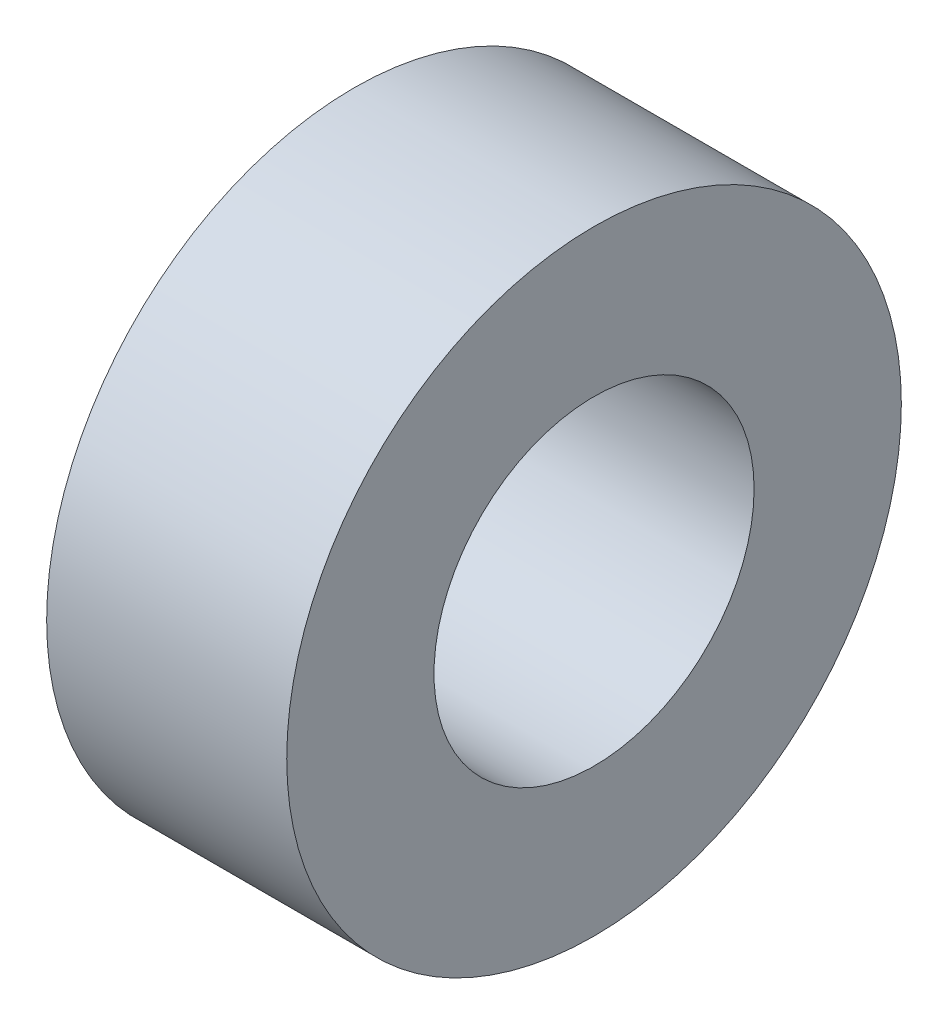
ISO-10303-21;
HEADER;
FILE_DESCRIPTION(('STEP AP214'),'2;1');
FILE_NAME('part.step','',(''),(''),'','','');
FILE_SCHEMA(('AUTOMOTIVE_DESIGN { 1 0 10303 214 1 1 1 1 }'));
ENDSEC;
DATA;
#1=APPLICATION_CONTEXT('core data for automotive mechanical design processes');
#2=APPLICATION_PROTOCOL_DEFINITION('international standard','automotive_design',2000,#1);
#3=PRODUCT_CONTEXT('',#1,'mechanical');
#4=PRODUCT('Part','Part','',(#3));
#5=PRODUCT_RELATED_PRODUCT_CATEGORY('part','',(#4));
#6=PRODUCT_DEFINITION_FORMATION('','',#4);
#7=PRODUCT_DEFINITION_CONTEXT('part definition',#1,'design');
#8=PRODUCT_DEFINITION('design','',#6,#7);
#9=PRODUCT_DEFINITION_SHAPE('','',#8);
#10=(LENGTH_UNIT() NAMED_UNIT(*) SI_UNIT(.MILLI.,.METRE.));
#11=(NAMED_UNIT(*) PLANE_ANGLE_UNIT() SI_UNIT($,.RADIAN.));
#12=(NAMED_UNIT(*) SI_UNIT($,.STERADIAN.) SOLID_ANGLE_UNIT());
#13=UNCERTAINTY_MEASURE_WITH_UNIT(LENGTH_MEASURE(1.E-05),#10,'distance_accuracy_value','');
#14=(GEOMETRIC_REPRESENTATION_CONTEXT(3) GLOBAL_UNCERTAINTY_ASSIGNED_CONTEXT((#13)) GLOBAL_UNIT_ASSIGNED_CONTEXT((#10,
#11,#12)) REPRESENTATION_CONTEXT('',''));
#15=CARTESIAN_POINT('',(0.,0.,0.));
#16=DIRECTION('',(0.,0.,1.));
#17=DIRECTION('',(1.,0.,0.));
#18=AXIS2_PLACEMENT_3D('',#15,#16,#17);
#19=CARTESIAN_POINT('',(4.7625,0.,0.));
#20=DIRECTION('',(1.,0.,0.));
#21=DIRECTION('',(0.,0.,-1.));
#22=AXIS2_PLACEMENT_3D('',#19,#20,#21);
#23=PLANE('',#22);
#24=CARTESIAN_POINT('',(4.7625,0.,0.));
#25=DIRECTION('',(1.,0.,0.));
#26=DIRECTION('',(0.,0.,-1.));
#27=AXIS2_PLACEMENT_3D('',#24,#25,#26);
#28=CIRCLE('',#27,6.096);
#29=CARTESIAN_POINT('',(4.7625,0.,-6.096));
#30=VERTEX_POINT('',#29);
#31=EDGE_CURVE('E10',#30,#30,#28,.T.);
#32=ORIENTED_EDGE('',*,*,#31,.T.);
#33=EDGE_LOOP('',(#32));
#34=FACE_BOUND('',#33,.T.);
#35=CARTESIAN_POINT('',(4.7625,0.,0.));
#36=DIRECTION('',(1.,0.,0.));
#37=DIRECTION('',(0.,0.,-1.));
#38=AXIS2_PLACEMENT_3D('',#35,#36,#37);
#39=CIRCLE('',#38,3.175);
#40=CARTESIAN_POINT('',(4.7625,0.,-3.175));
#41=VERTEX_POINT('',#40);
#42=EDGE_CURVE('E50',#41,#41,#39,.T.);
#43=ORIENTED_EDGE('',*,*,#42,.F.);
#44=EDGE_LOOP('',(#43));
#45=FACE_BOUND('',#44,.T.);
#46=ADVANCED_FACE('F39',(#34,#45),#23,.T.);
#47=CARTESIAN_POINT('',(0.,0.,0.));
#48=DIRECTION('',(1.,0.,0.));
#49=DIRECTION('',(0.,0.,-1.));
#50=AXIS2_PLACEMENT_3D('',#47,#48,#49);
#51=PLANE('',#50);
#52=CARTESIAN_POINT('',(0.,0.,0.));
#53=DIRECTION('',(1.,0.,0.));
#54=DIRECTION('',(0.,0.,-1.));
#55=AXIS2_PLACEMENT_3D('',#52,#53,#54);
#56=CIRCLE('',#55,6.096);
#57=CARTESIAN_POINT('',(0.,0.,-6.096));
#58=VERTEX_POINT('',#57);
#59=EDGE_CURVE('E43',#58,#58,#56,.T.);
#60=ORIENTED_EDGE('',*,*,#59,.F.);
#61=EDGE_LOOP('',(#60));
#62=FACE_BOUND('',#61,.T.);
#63=CARTESIAN_POINT('',(0.,0.,0.));
#64=DIRECTION('',(1.,0.,0.));
#65=DIRECTION('',(0.,0.,-1.));
#66=AXIS2_PLACEMENT_3D('',#63,#64,#65);
#67=CIRCLE('',#66,3.175);
#68=CARTESIAN_POINT('',(0.,0.,-3.175));
#69=VERTEX_POINT('',#68);
#70=EDGE_CURVE('E52',#69,#69,#67,.T.);
#71=ORIENTED_EDGE('',*,*,#70,.T.);
#72=EDGE_LOOP('',(#71));
#73=FACE_BOUND('',#72,.T.);
#74=ADVANCED_FACE('F62',(#62,#73),#51,.F.);
#75=CARTESIAN_POINT('',(4.7625,0.,0.));
#76=DIRECTION('',(-1.,0.,0.));
#77=DIRECTION('',(0.,0.,1.));
#78=AXIS2_PLACEMENT_3D('',#75,#76,#77);
#79=CYLINDRICAL_SURFACE('',#78,6.096);
#80=ORIENTED_EDGE('',*,*,#31,.F.);
#81=EDGE_LOOP('',(#80));
#82=FACE_BOUND('',#81,.T.);
#83=ORIENTED_EDGE('',*,*,#59,.T.);
#84=EDGE_LOOP('',(#83));
#85=FACE_BOUND('',#84,.T.);
#86=ADVANCED_FACE('F41',(#82,#85),#79,.T.);
#87=CARTESIAN_POINT('',(4.7625,0.,0.));
#88=DIRECTION('',(-1.,0.,0.));
#89=DIRECTION('',(0.,0.,1.));
#90=AXIS2_PLACEMENT_3D('',#87,#88,#89);
#91=CYLINDRICAL_SURFACE('',#90,3.175);
#92=ORIENTED_EDGE('',*,*,#42,.T.);
#93=EDGE_LOOP('',(#92));
#94=FACE_BOUND('',#93,.T.);
#95=ORIENTED_EDGE('',*,*,#70,.F.);
#96=EDGE_LOOP('',(#95));
#97=FACE_BOUND('',#96,.T.);
#98=ADVANCED_FACE('F58',(#94,#97),#91,.F.);
#99=CLOSED_SHELL('',(#46,#74,#86,#98));
#100=MANIFOLD_SOLID_BREP('B2',#99);
#101=ADVANCED_BREP_SHAPE_REPRESENTATION('',(#18,#100),#14);
#102=SHAPE_DEFINITION_REPRESENTATION(#9,#101);
ENDSEC;
END-ISO-10303-21;
